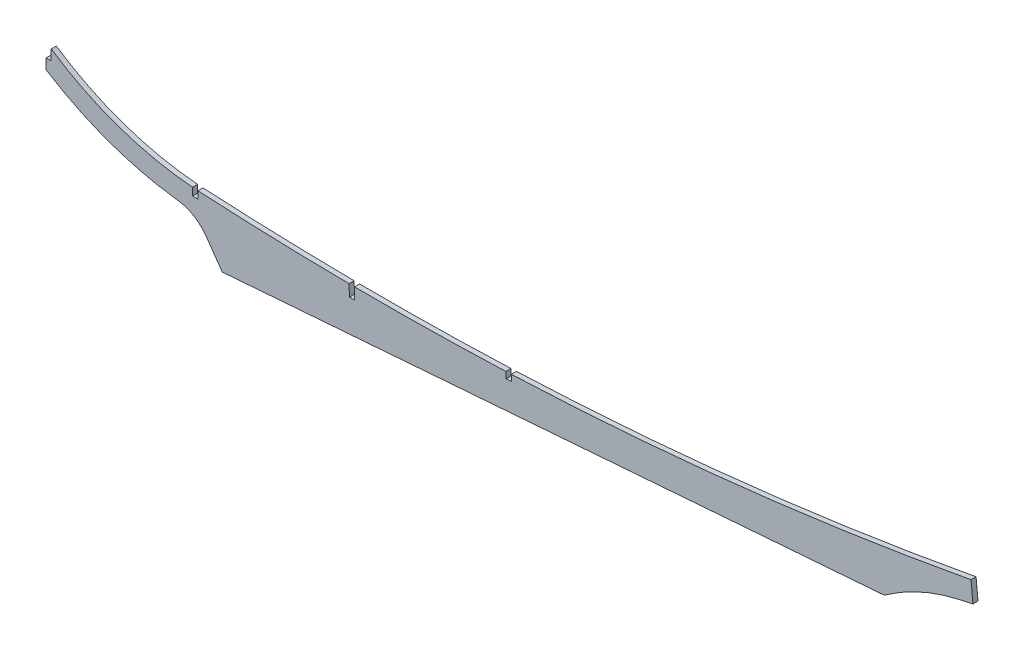
ISO-10303-21;
HEADER;
FILE_DESCRIPTION(('STEP AP214'),'2;1');
FILE_NAME('part.step','',(''),(''),'','','');
FILE_SCHEMA(('AUTOMOTIVE_DESIGN { 1 0 10303 214 1 1 1 1 }'));
ENDSEC;
DATA;
#1=APPLICATION_CONTEXT('core data for automotive mechanical design processes');
#2=APPLICATION_PROTOCOL_DEFINITION('international standard','automotive_design',2000,#1);
#3=PRODUCT_CONTEXT('',#1,'mechanical');
#4=PRODUCT('Part','Part','',(#3));
#5=PRODUCT_RELATED_PRODUCT_CATEGORY('part','',(#4));
#6=PRODUCT_DEFINITION_FORMATION('','',#4);
#7=PRODUCT_DEFINITION_CONTEXT('part definition',#1,'design');
#8=PRODUCT_DEFINITION('design','',#6,#7);
#9=PRODUCT_DEFINITION_SHAPE('','',#8);
#10=(LENGTH_UNIT() NAMED_UNIT(*) SI_UNIT(.MILLI.,.METRE.));
#11=(NAMED_UNIT(*) PLANE_ANGLE_UNIT() SI_UNIT($,.RADIAN.));
#12=(NAMED_UNIT(*) SI_UNIT($,.STERADIAN.) SOLID_ANGLE_UNIT());
#13=UNCERTAINTY_MEASURE_WITH_UNIT(LENGTH_MEASURE(1.E-05),#10,'distance_accuracy_value','');
#14=(GEOMETRIC_REPRESENTATION_CONTEXT(3) GLOBAL_UNCERTAINTY_ASSIGNED_CONTEXT((#13)) GLOBAL_UNIT_ASSIGNED_CONTEXT((#10,
#11,#12)) REPRESENTATION_CONTEXT('',''));
#15=CARTESIAN_POINT('',(0.,0.,0.));
#16=DIRECTION('',(0.,0.,1.));
#17=DIRECTION('',(1.,0.,0.));
#18=AXIS2_PLACEMENT_3D('',#15,#16,#17);
#19=CARTESIAN_POINT('',(209.00386269638,1921.26005107416,1.5875));
#20=DIRECTION('',(0.,0.,-1.));
#21=DIRECTION('',(-1.,0.,0.));
#22=AXIS2_PLACEMENT_3D('',#19,#20,#21);
#23=CYLINDRICAL_SURFACE('',#22,2040.06441212445);
#24=DIRECTION('',(0.,0.,-1.));
#25=VECTOR('',#24,1.);
#26=CARTESIAN_POINT('',(95.6691,-115.653800118673,1.5875));
#27=LINE('',#26,#25);
#28=CARTESIAN_POINT('',(95.6691,-115.653800118673,1.5875));
#29=VERTEX_POINT('',#28);
#30=CARTESIAN_POINT('',(95.6691,-115.653800118673,-1.5875));
#31=VERTEX_POINT('',#30);
#32=EDGE_CURVE('E298',#29,#31,#27,.T.);
#33=ORIENTED_EDGE('',*,*,#32,.F.);
#34=CARTESIAN_POINT('',(209.00386269638,1921.26005107416,1.5875));
#35=DIRECTION('',(0.,0.,1.));
#36=DIRECTION('',(1.,0.,0.));
#37=AXIS2_PLACEMENT_3D('',#34,#35,#36);
#38=CIRCLE('',#37,2040.06441212445);
#39=CARTESIAN_POINT('',(190.812248922999,-118.723250525386,1.5875));
#40=VERTEX_POINT('',#39);
#41=EDGE_CURVE('E249',#29,#40,#38,.T.);
#42=ORIENTED_EDGE('',*,*,#41,.T.);
#43=DIRECTION('',(0.,0.,-1.));
#44=VECTOR('',#43,1.);
#45=CARTESIAN_POINT('',(190.812248922999,-118.723250525385,1.5875));
#46=LINE('',#45,#44);
#47=CARTESIAN_POINT('',(190.812248922999,-118.723250525386,-1.5875));
#48=VERTEX_POINT('',#47);
#49=EDGE_CURVE('E290',#48,#40,#46,.F.);
#50=ORIENTED_EDGE('',*,*,#49,.F.);
#51=CARTESIAN_POINT('',(209.00386269638,1921.26005107416,-1.5875));
#52=DIRECTION('',(0.,0.,1.));
#53=DIRECTION('',(1.,0.,0.));
#54=AXIS2_PLACEMENT_3D('',#51,#52,#53);
#55=CIRCLE('',#54,2040.06441212445);
#56=EDGE_CURVE('E244',#31,#48,#55,.T.);
#57=ORIENTED_EDGE('',*,*,#56,.F.);
#58=EDGE_LOOP('',(#33,#42,#50,#57));
#59=FACE_BOUND('',#58,.T.);
#60=ADVANCED_FACE('F38',(#59),#23,.F.);
#61=DIRECTION('',(0.,0.,-1.));
#62=VECTOR('',#61,1.);
#63=CARTESIAN_POINT('',(194.191761428188,-118.75058793552,1.5875));
#64=LINE('',#63,#62);
#65=CARTESIAN_POINT('',(194.191761428188,-118.750587935521,1.5875));
#66=VERTEX_POINT('',#65);
#67=CARTESIAN_POINT('',(194.191761428188,-118.750587935521,-1.5875));
#68=VERTEX_POINT('',#67);
#69=EDGE_CURVE('E299',#66,#68,#64,.T.);
#70=ORIENTED_EDGE('',*,*,#69,.F.);
#71=CARTESIAN_POINT('',(289.528455693437,-117.21452456796,1.5875));
#72=VERTEX_POINT('',#71);
#73=EDGE_CURVE('E328',#66,#72,#38,.T.);
#74=ORIENTED_EDGE('',*,*,#73,.T.);
#75=DIRECTION('',(0.,0.,-1.));
#76=VECTOR('',#75,1.);
#77=CARTESIAN_POINT('',(289.528455693437,-117.214524567959,1.5875));
#78=LINE('',#77,#76);
#79=CARTESIAN_POINT('',(289.528455693437,-117.21452456796,-1.5875));
#80=VERTEX_POINT('',#79);
#81=EDGE_CURVE('E303',#80,#72,#78,.F.);
#82=ORIENTED_EDGE('',*,*,#81,.F.);
#83=EDGE_CURVE('E243',#68,#80,#55,.T.);
#84=ORIENTED_EDGE('',*,*,#83,.F.);
#85=EDGE_LOOP('',(#70,#74,#82,#84));
#86=FACE_BOUND('',#85,.T.);
#87=ADVANCED_FACE('F337',(#86),#23,.F.);
#88=CARTESIAN_POINT('',(107.235093104916,71.12,1.5875));
#89=DIRECTION('',(0.,0.,-1.));
#90=DIRECTION('',(-1.,0.,0.));
#91=AXIS2_PLACEMENT_3D('',#88,#89,#90);
#92=CYLINDRICAL_SURFACE('',#91,187.149110586238);
#93=DIRECTION('',(0.,0.,-1.));
#94=VECTOR('',#93,1.);
#95=CARTESIAN_POINT('',(3.30200000000001,-84.5164409476936,1.5875));
#96=LINE('',#95,#94);
#97=CARTESIAN_POINT('',(3.30200000000001,-84.5164409476936,1.5875));
#98=VERTEX_POINT('',#97);
#99=CARTESIAN_POINT('',(3.30200000000001,-84.5164409476936,-1.5875));
#100=VERTEX_POINT('',#99);
#101=EDGE_CURVE('E226',#98,#100,#96,.T.);
#102=ORIENTED_EDGE('',*,*,#101,.F.);
#103=CARTESIAN_POINT('',(107.235093104916,71.12,1.5875));
#104=DIRECTION('',(0.,0.,1.));
#105=DIRECTION('',(1.,0.,0.));
#106=AXIS2_PLACEMENT_3D('',#103,#104,#105);
#107=CIRCLE('',#106,187.149110586238);
#108=CARTESIAN_POINT('',(92.2909,-115.431496069217,1.5875));
#109=VERTEX_POINT('',#108);
#110=EDGE_CURVE('E309',#98,#109,#107,.T.);
#111=ORIENTED_EDGE('',*,*,#110,.T.);
#112=DIRECTION('',(0.,0.,-1.));
#113=VECTOR('',#112,1.);
#114=CARTESIAN_POINT('',(92.2909,-115.431496069217,1.5875));
#115=LINE('',#114,#113);
#116=CARTESIAN_POINT('',(92.2909,-115.431496069217,-1.5875));
#117=VERTEX_POINT('',#116);
#118=EDGE_CURVE('E301',#117,#109,#115,.F.);
#119=ORIENTED_EDGE('',*,*,#118,.F.);
#120=CARTESIAN_POINT('',(107.235093104916,71.12,-1.5875));
#121=DIRECTION('',(0.,0.,1.));
#122=DIRECTION('',(1.,0.,0.));
#123=AXIS2_PLACEMENT_3D('',#120,#121,#122);
#124=CIRCLE('',#123,187.149110586238);
#125=EDGE_CURVE('E221',#100,#117,#124,.T.);
#126=ORIENTED_EDGE('',*,*,#125,.F.);
#127=EDGE_LOOP('',(#102,#111,#119,#126));
#128=FACE_BOUND('',#127,.T.);
#129=ADVANCED_FACE('F413',(#128),#92,.F.);
#130=CARTESIAN_POINT('',(0.,0.,1.5875));
#131=DIRECTION('',(-1.,0.,0.));
#132=DIRECTION('',(0.,-1.,0.));
#133=AXIS2_PLACEMENT_3D('',#130,#131,#132);
#134=PLANE('',#133);
#135=DIRECTION('',(0.,0.,1.));
#136=VECTOR('',#135,1.);
#137=CARTESIAN_POINT('',(0.,-91.0752471098096,-1.5875));
#138=LINE('',#137,#136);
#139=CARTESIAN_POINT('',(0.,-91.0752471098096,-1.5875));
#140=VERTEX_POINT('',#139);
#141=CARTESIAN_POINT('',(0.,-91.0752471098096,1.5875));
#142=VERTEX_POINT('',#141);
#143=EDGE_CURVE('E202',#140,#142,#138,.T.);
#144=ORIENTED_EDGE('',*,*,#143,.F.);
#145=DIRECTION('',(0.,1.,0.));
#146=VECTOR('',#145,1.);
#147=CARTESIAN_POINT('',(0.,0.,-1.5875));
#148=LINE('',#147,#146);
#149=CARTESIAN_POINT('',(-2.22044604925031E-13,-97.5,-1.5875));
#150=VERTEX_POINT('',#149);
#151=EDGE_CURVE('E213',#150,#140,#148,.T.);
#152=ORIENTED_EDGE('',*,*,#151,.F.);
#153=DIRECTION('',(0.,0.,-1.));
#154=VECTOR('',#153,1.);
#155=CARTESIAN_POINT('',(-2.22044604925031E-13,-97.5,1.5875));
#156=LINE('',#155,#154);
#157=CARTESIAN_POINT('',(-2.22044604925031E-13,-97.5,1.5875));
#158=VERTEX_POINT('',#157);
#159=EDGE_CURVE('E258',#158,#150,#156,.T.);
#160=ORIENTED_EDGE('',*,*,#159,.F.);
#161=DIRECTION('',(0.,1.,0.));
#162=VECTOR('',#161,1.);
#163=CARTESIAN_POINT('',(0.,0.,1.5875));
#164=LINE('',#163,#162);
#165=EDGE_CURVE('E215',#158,#142,#164,.T.);
#166=ORIENTED_EDGE('',*,*,#165,.T.);
#167=EDGE_LOOP('',(#144,#152,#160,#166));
#168=FACE_BOUND('',#167,.T.);
#169=ADVANCED_FACE('F212',(#168),#134,.T.);
#170=CARTESIAN_POINT('',(107.235093104916,71.12,1.5875));
#171=DIRECTION('',(0.,0.,-1.));
#172=DIRECTION('',(-1.,0.,0.));
#173=AXIS2_PLACEMENT_3D('',#170,#171,#172);
#174=CYLINDRICAL_SURFACE('',#173,199.830101819571);
#175=CARTESIAN_POINT('',(107.235093104916,71.12,-1.5875));
#176=DIRECTION('',(0.,0.,1.));
#177=DIRECTION('',(1.,0.,0.));
#178=AXIS2_PLACEMENT_3D('',#175,#176,#177);
#179=CIRCLE('',#178,199.830101819571);
#180=CARTESIAN_POINT('',(83.0420867198409,-127.240197709298,-1.5875));
#181=VERTEX_POINT('',#180);
#182=EDGE_CURVE('E220',#150,#181,#179,.T.);
#183=ORIENTED_EDGE('',*,*,#182,.T.);
#184=DIRECTION('',(0.,0.,-1.));
#185=VECTOR('',#184,1.);
#186=CARTESIAN_POINT('',(83.0420867198409,-127.240197709298,1.5875));
#187=LINE('',#186,#185);
#188=CARTESIAN_POINT('',(83.0420867198409,-127.240197709298,1.5875));
#189=VERTEX_POINT('',#188);
#190=EDGE_CURVE('E272',#181,#189,#187,.F.);
#191=ORIENTED_EDGE('',*,*,#190,.T.);
#192=CARTESIAN_POINT('',(107.235093104916,71.12,1.5875));
#193=DIRECTION('',(0.,0.,1.));
#194=DIRECTION('',(1.,0.,0.));
#195=AXIS2_PLACEMENT_3D('',#192,#193,#194);
#196=CIRCLE('',#195,199.830101819571);
#197=EDGE_CURVE('E313',#158,#189,#196,.T.);
#198=ORIENTED_EDGE('',*,*,#197,.F.);
#199=ORIENTED_EDGE('',*,*,#159,.T.);
#200=EDGE_LOOP('',(#183,#191,#198,#199));
#201=FACE_BOUND('',#200,.T.);
#202=ADVANCED_FACE('F440',(#201),#174,.T.);
#203=CARTESIAN_POINT('',(2.22985538438366,1.57563672640154,1.5875));
#204=DIRECTION('',(0.816688031445794,0.577079421997696,0.));
#205=DIRECTION('',(-0.577079421997696,0.816688031445794,0.));
#206=AXIS2_PLACEMENT_3D('',#203,#204,#205);
#207=PLANE('',#206);
#208=DIRECTION('',(0.577079421997696,-0.816688031445794,0.));
#209=VECTOR('',#208,1.);
#210=CARTESIAN_POINT('',(2.22985538438366,1.57563672640154,1.5875));
#211=LINE('',#210,#209);
#212=CARTESIAN_POINT('',(100.710838617713,-137.795543852613,1.5875));
#213=VERTEX_POINT('',#212);
#214=CARTESIAN_POINT('',(110.986490965694,-152.33774024361,1.5875));
#215=VERTEX_POINT('',#214);
#216=EDGE_CURVE('E316',#213,#215,#211,.T.);
#217=ORIENTED_EDGE('',*,*,#216,.F.);
#218=DIRECTION('',(0.,0.,1.));
#219=VECTOR('',#218,1.);
#220=CARTESIAN_POINT('',(100.710838617713,-137.795543852613,-1.5875));
#221=LINE('',#220,#219);
#222=CARTESIAN_POINT('',(100.710838617713,-137.795543852613,-1.5875));
#223=VERTEX_POINT('',#222);
#224=EDGE_CURVE('E269',#213,#223,#221,.F.);
#225=ORIENTED_EDGE('',*,*,#224,.T.);
#226=DIRECTION('',(0.577079421997696,-0.816688031445794,0.));
#227=VECTOR('',#226,1.);
#228=CARTESIAN_POINT('',(2.22985538438366,1.57563672640154,-1.5875));
#229=LINE('',#228,#227);
#230=CARTESIAN_POINT('',(110.986490965694,-152.33774024361,-1.5875));
#231=VERTEX_POINT('',#230);
#232=EDGE_CURVE('E223',#223,#231,#229,.T.);
#233=ORIENTED_EDGE('',*,*,#232,.T.);
#234=DIRECTION('',(0.,0.,-1.));
#235=VECTOR('',#234,1.);
#236=CARTESIAN_POINT('',(110.986490965694,-152.33774024361,1.5875));
#237=LINE('',#236,#235);
#238=EDGE_CURVE('E255',#215,#231,#237,.T.);
#239=ORIENTED_EDGE('',*,*,#238,.F.);
#240=EDGE_LOOP('',(#217,#225,#233,#239));
#241=FACE_BOUND('',#240,.T.);
#242=ADVANCED_FACE('F436',(#241),#207,.F.);
#243=CARTESIAN_POINT('',(12.3596923978808,-159.958449832639,1.5875));
#244=DIRECTION('',(-0.0770385113227414,0.997028117844816,0.));
#245=DIRECTION('',(-0.997028117844816,-0.0770385113227414,0.));
#246=AXIS2_PLACEMENT_3D('',#243,#244,#245);
#247=PLANE('',#246);
#248=DIRECTION('',(0.997028117844816,0.0770385113227414,0.));
#249=VECTOR('',#248,1.);
#250=CARTESIAN_POINT('',(12.3596923978808,-159.958449832639,-1.5875));
#251=LINE('',#250,#249);
#252=CARTESIAN_POINT('',(527.710073755712,-120.138282799403,-1.5875));
#253=VERTEX_POINT('',#252);
#254=EDGE_CURVE('E231',#231,#253,#251,.T.);
#255=ORIENTED_EDGE('',*,*,#254,.T.);
#256=DIRECTION('',(0.,0.,-1.));
#257=VECTOR('',#256,1.);
#258=CARTESIAN_POINT('',(527.710073755712,-120.138282799403,1.5875));
#259=LINE('',#258,#257);
#260=CARTESIAN_POINT('',(527.710073755712,-120.138282799403,1.5875));
#261=VERTEX_POINT('',#260);
#262=EDGE_CURVE('E252',#261,#253,#259,.T.);
#263=ORIENTED_EDGE('',*,*,#262,.F.);
#264=DIRECTION('',(0.997028117844816,0.0770385113227414,0.));
#265=VECTOR('',#264,1.);
#266=CARTESIAN_POINT('',(12.3596923978808,-159.958449832639,1.5875));
#267=LINE('',#266,#265);
#268=EDGE_CURVE('E318',#215,#261,#267,.T.);
#269=ORIENTED_EDGE('',*,*,#268,.F.);
#270=ORIENTED_EDGE('',*,*,#238,.T.);
#271=EDGE_LOOP('',(#255,#263,#269,#270));
#272=FACE_BOUND('',#271,.T.);
#273=ADVANCED_FACE('F432',(#272),#247,.F.);
#274=CARTESIAN_POINT('',(230.057828257937,-328.556628861992,1.5875));
#275=DIRECTION('',(-0.573576436351047,0.819152044288991,0.));
#276=DIRECTION('',(-0.819152044288991,-0.573576436351047,0.));
#277=AXIS2_PLACEMENT_3D('',#274,#275,#276);
#278=PLANE('',#277);
#279=DIRECTION('',(0.819152044288991,0.573576436351047,0.));
#280=VECTOR('',#279,1.);
#281=CARTESIAN_POINT('',(230.057828257937,-328.556628861992,-1.5875));
#282=LINE('',#281,#280);
#283=CARTESIAN_POINT('',(529.532384787141,-118.862286878233,-1.5875));
#284=VERTEX_POINT('',#283);
#285=EDGE_CURVE('E233',#253,#284,#282,.T.);
#286=ORIENTED_EDGE('',*,*,#285,.T.);
#287=DIRECTION('',(0.,0.,-1.));
#288=VECTOR('',#287,1.);
#289=CARTESIAN_POINT('',(529.532384787141,-118.862286878233,1.5875));
#290=LINE('',#289,#288);
#291=CARTESIAN_POINT('',(529.532384787141,-118.862286878233,1.5875));
#292=VERTEX_POINT('',#291);
#293=EDGE_CURVE('E263',#284,#292,#290,.F.);
#294=ORIENTED_EDGE('',*,*,#293,.T.);
#295=DIRECTION('',(0.819152044288991,0.573576436351047,0.));
#296=VECTOR('',#295,1.);
#297=CARTESIAN_POINT('',(230.057828257937,-328.556628861992,1.5875));
#298=LINE('',#297,#296);
#299=EDGE_CURVE('E320',#261,#292,#298,.T.);
#300=ORIENTED_EDGE('',*,*,#299,.F.);
#301=ORIENTED_EDGE('',*,*,#262,.T.);
#302=EDGE_LOOP('',(#286,#294,#300,#301));
#303=FACE_BOUND('',#302,.T.);
#304=ADVANCED_FACE('F426',(#303),#278,.F.);
#305=CARTESIAN_POINT('',(47.4401912082167,-215.186600833362,1.5875));
#306=DIRECTION('',(-0.215290899834292,0.976549962085167,0.));
#307=DIRECTION('',(-0.976549962085167,-0.215290899834292,0.));
#308=AXIS2_PLACEMENT_3D('',#305,#306,#307);
#309=PLANE('',#308);
#310=DIRECTION('',(0.976549962085167,0.215290899834292,0.));
#311=VECTOR('',#310,1.);
#312=CARTESIAN_POINT('',(47.4401912082167,-215.186600833362,1.5875));
#313=LINE('',#312,#311);
#314=CARTESIAN_POINT('',(575.034647924769,-98.872751318119,1.5875));
#315=VERTEX_POINT('',#314);
#316=CARTESIAN_POINT('',(583.52308290764,-97.0013848989906,1.5875));
#317=VERTEX_POINT('',#316);
#318=EDGE_CURVE('E323',#315,#317,#313,.T.);
#319=ORIENTED_EDGE('',*,*,#318,.F.);
#320=DIRECTION('',(0.,0.,-1.));
#321=VECTOR('',#320,1.);
#322=CARTESIAN_POINT('',(575.034647924769,-98.872751318119,-1.5875));
#323=LINE('',#322,#321);
#324=CARTESIAN_POINT('',(575.034647924769,-98.872751318119,-1.5875));
#325=VERTEX_POINT('',#324);
#326=EDGE_CURVE('E260',#315,#325,#323,.T.);
#327=ORIENTED_EDGE('',*,*,#326,.T.);
#328=DIRECTION('',(0.976549962085167,0.215290899834292,0.));
#329=VECTOR('',#328,1.);
#330=CARTESIAN_POINT('',(47.4401912082167,-215.186600833362,-1.5875));
#331=LINE('',#330,#329);
#332=CARTESIAN_POINT('',(583.52308290764,-97.0013848989906,-1.5875));
#333=VERTEX_POINT('',#332);
#334=EDGE_CURVE('E236',#325,#333,#331,.T.);
#335=ORIENTED_EDGE('',*,*,#334,.T.);
#336=DIRECTION('',(0.,0.,-1.));
#337=VECTOR('',#336,1.);
#338=CARTESIAN_POINT('',(583.52308290764,-97.0013848989906,1.5875));
#339=LINE('',#338,#337);
#340=EDGE_CURVE('E248',#317,#333,#339,.T.);
#341=ORIENTED_EDGE('',*,*,#340,.F.);
#342=EDGE_LOOP('',(#319,#327,#335,#341));
#343=FACE_BOUND('',#342,.T.);
#344=ADVANCED_FACE('F422',(#343),#309,.F.);
#345=CARTESIAN_POINT('',(568.782339813287,55.1168326892252,1.5875));
#346=DIRECTION('',(-0.995337693784419,-0.0964514143593203,0.));
#347=DIRECTION('',(0.0964514143593203,-0.99533769378442,0.));
#348=AXIS2_PLACEMENT_3D('',#345,#346,#347);
#349=PLANE('',#348);
#350=DIRECTION('',(-0.0964514143593203,0.995337693784419,0.));
#351=VECTOR('',#350,1.);
#352=CARTESIAN_POINT('',(568.782339813287,55.1168326892252,-1.5875));
#353=LINE('',#352,#351);
#354=CARTESIAN_POINT('',(582.298149945277,-84.3605961879285,-1.5875));
#355=VERTEX_POINT('',#354);
#356=EDGE_CURVE('E238',#333,#355,#353,.T.);
#357=ORIENTED_EDGE('',*,*,#356,.T.);
#358=DIRECTION('',(0.,0.,-1.));
#359=VECTOR('',#358,1.);
#360=CARTESIAN_POINT('',(582.298149945277,-84.3605961879285,1.5875));
#361=LINE('',#360,#359);
#362=CARTESIAN_POINT('',(582.298149945277,-84.3605961879285,1.5875));
#363=VERTEX_POINT('',#362);
#364=EDGE_CURVE('E245',#363,#355,#361,.T.);
#365=ORIENTED_EDGE('',*,*,#364,.F.);
#366=DIRECTION('',(-0.0964514143593203,0.995337693784419,0.));
#367=VECTOR('',#366,1.);
#368=CARTESIAN_POINT('',(568.782339813287,55.1168326892252,1.5875));
#369=LINE('',#368,#367);
#370=EDGE_CURVE('E325',#317,#363,#369,.T.);
#371=ORIENTED_EDGE('',*,*,#370,.F.);
#372=ORIENTED_EDGE('',*,*,#340,.T.);
#373=EDGE_LOOP('',(#357,#365,#371,#372));
#374=FACE_BOUND('',#373,.T.);
#375=ADVANCED_FACE('F393',(#374),#349,.F.);
#376=DIRECTION('',(0.,0.,-1.));
#377=VECTOR('',#376,1.);
#378=CARTESIAN_POINT('',(292.903923813643,-117.078386320666,1.5875));
#379=LINE('',#378,#377);
#380=CARTESIAN_POINT('',(292.903923813643,-117.078386320667,1.5875));
#381=VERTEX_POINT('',#380);
#382=CARTESIAN_POINT('',(292.903923813643,-117.078386320667,-1.5875));
#383=VERTEX_POINT('',#382);
#384=EDGE_CURVE('E368',#381,#383,#379,.T.);
#385=ORIENTED_EDGE('',*,*,#384,.F.);
#386=EDGE_CURVE('E327',#381,#363,#38,.T.);
#387=ORIENTED_EDGE('',*,*,#386,.T.);
#388=ORIENTED_EDGE('',*,*,#364,.T.);
#389=EDGE_CURVE('E241',#383,#355,#55,.T.);
#390=ORIENTED_EDGE('',*,*,#389,.F.);
#391=EDGE_LOOP('',(#385,#387,#388,#390));
#392=FACE_BOUND('',#391,.T.);
#393=ADVANCED_FACE('F387',(#392),#23,.F.);
#394=CARTESIAN_POINT('',(0.,0.,1.5875));
#395=DIRECTION('',(0.,0.,1.));
#396=DIRECTION('',(1.,0.,0.));
#397=AXIS2_PLACEMENT_3D('',#394,#395,#396);
#398=PLANE('',#397);
#399=DIRECTION('',(0.,1.,0.));
#400=VECTOR('',#399,1.);
#401=CARTESIAN_POINT('',(3.30200000000001,-91.0752471098096,1.5875));
#402=LINE('',#401,#400);
#403=CARTESIAN_POINT('',(3.30200000000001,-91.0752471098096,1.5875));
#404=VERTEX_POINT('',#403);
#405=EDGE_CURVE('E207',#404,#98,#402,.T.);
#406=ORIENTED_EDGE('',*,*,#405,.F.);
#407=DIRECTION('',(1.,0.,0.));
#408=VECTOR('',#407,1.);
#409=CARTESIAN_POINT('',(0.,-91.0752471098096,1.5875));
#410=LINE('',#409,#408);
#411=EDGE_CURVE('E472',#142,#404,#410,.T.);
#412=ORIENTED_EDGE('',*,*,#411,.F.);
#413=ORIENTED_EDGE('',*,*,#165,.F.);
#414=ORIENTED_EDGE('',*,*,#197,.T.);
#415=CARTESIAN_POINT('',(79.9669626189898,-152.453361171354,1.5875));
#416=DIRECTION('',(0.,0.,1.));
#417=DIRECTION('',(1.,0.,0.));
#418=AXIS2_PLACEMENT_3D('',#415,#416,#417);
#419=CIRCLE('',#418,25.4);
#420=EDGE_CURVE('E276',#189,#213,#419,.F.);
#421=ORIENTED_EDGE('',*,*,#420,.T.);
#422=ORIENTED_EDGE('',*,*,#216,.T.);
#423=ORIENTED_EDGE('',*,*,#268,.T.);
#424=ORIENTED_EDGE('',*,*,#299,.T.);
#425=CARTESIAN_POINT('',(602.376592203724,-222.894596502935,1.5875));
#426=DIRECTION('',(0.,0.,1.));
#427=DIRECTION('',(1.,0.,0.));
#428=AXIS2_PLACEMENT_3D('',#425,#426,#427);
#429=CIRCLE('',#428,127.);
#430=EDGE_CURVE('E267',#292,#315,#429,.F.);
#431=ORIENTED_EDGE('',*,*,#430,.T.);
#432=ORIENTED_EDGE('',*,*,#318,.T.);
#433=ORIENTED_EDGE('',*,*,#370,.T.);
#434=ORIENTED_EDGE('',*,*,#386,.F.);
#435=DIRECTION('',(-0.0430000788380031,0.999075068861157,0.));
#436=VECTOR('',#435,1.);
#437=CARTESIAN_POINT('',(293.073061119761,-121.008166691369,1.5875));
#438=LINE('',#437,#436);
#439=CARTESIAN_POINT('',(293.073061119761,-121.008166691369,1.5875));
#440=VERTEX_POINT('',#439);
#441=EDGE_CURVE('E357',#440,#381,#438,.T.);
#442=ORIENTED_EDGE('',*,*,#441,.F.);
#443=DIRECTION('',(0.999075068861157,0.0430000788380023,0.));
#444=VECTOR('',#443,1.);
#445=CARTESIAN_POINT('',(289.697985722134,-121.1534295577,1.5875));
#446=LINE('',#445,#444);
#447=CARTESIAN_POINT('',(289.697985722134,-121.1534295577,1.5875));
#448=VERTEX_POINT('',#447);
#449=EDGE_CURVE('E351',#448,#440,#446,.T.);
#450=ORIENTED_EDGE('',*,*,#449,.F.);
#451=DIRECTION('',(0.0430000788380031,-0.999075068861157,0.));
#452=VECTOR('',#451,1.);
#453=CARTESIAN_POINT('',(289.697985722134,-121.1534295577,1.5875));
#454=LINE('',#453,#452);
#455=EDGE_CURVE('E348',#72,#448,#454,.T.);
#456=ORIENTED_EDGE('',*,*,#455,.F.);
#457=ORIENTED_EDGE('',*,*,#73,.F.);
#458=DIRECTION('',(-0.0209302977680573,0.999780937323442,0.));
#459=VECTOR('',#458,1.);
#460=CARTESIAN_POINT('',(194.342678534027,-125.959469873391,1.5875));
#461=LINE('',#460,#459);
#462=CARTESIAN_POINT('',(194.342678534027,-125.959469873391,1.5875));
#463=VERTEX_POINT('',#462);
#464=EDGE_CURVE('E346',#463,#66,#461,.T.);
#465=ORIENTED_EDGE('',*,*,#464,.F.);
#466=DIRECTION('',(0.999780937323442,0.0209302977680589,0.));
#467=VECTOR('',#466,1.);
#468=CARTESIAN_POINT('',(190.965218571561,-126.030176605311,1.5875));
#469=LINE('',#468,#467);
#470=CARTESIAN_POINT('',(190.965218571561,-126.030176605311,1.5875));
#471=VERTEX_POINT('',#470);
#472=EDGE_CURVE('E495',#471,#463,#469,.T.);
#473=ORIENTED_EDGE('',*,*,#472,.F.);
#474=DIRECTION('',(0.0209302977680573,-0.999780937323442,0.));
#475=VECTOR('',#474,1.);
#476=CARTESIAN_POINT('',(190.965218571561,-126.030176605311,1.5875));
#477=LINE('',#476,#475);
#478=EDGE_CURVE('E378',#40,#471,#477,.T.);
#479=ORIENTED_EDGE('',*,*,#478,.F.);
#480=ORIENTED_EDGE('',*,*,#41,.F.);
#481=DIRECTION('',(0.,1.,0.));
#482=VECTOR('',#481,1.);
#483=CARTESIAN_POINT('',(95.6691,-120.263391429802,1.5875));
#484=LINE('',#483,#482);
#485=CARTESIAN_POINT('',(95.6691,-120.263391429802,1.5875));
#486=VERTEX_POINT('',#485);
#487=EDGE_CURVE('E487',#486,#29,#484,.T.);
#488=ORIENTED_EDGE('',*,*,#487,.F.);
#489=DIRECTION('',(1.,0.,0.));
#490=VECTOR('',#489,1.);
#491=CARTESIAN_POINT('',(92.2909,-120.263391429802,1.5875));
#492=LINE('',#491,#490);
#493=CARTESIAN_POINT('',(92.2909,-120.263391429802,1.5875));
#494=VERTEX_POINT('',#493);
#495=EDGE_CURVE('E477',#494,#486,#492,.T.);
#496=ORIENTED_EDGE('',*,*,#495,.F.);
#497=DIRECTION('',(0.,-1.,0.));
#498=VECTOR('',#497,1.);
#499=CARTESIAN_POINT('',(92.2909,-120.263391429802,1.5875));
#500=LINE('',#499,#498);
#501=EDGE_CURVE('E474',#109,#494,#500,.T.);
#502=ORIENTED_EDGE('',*,*,#501,.F.);
#503=ORIENTED_EDGE('',*,*,#110,.F.);
#504=EDGE_LOOP('',(#406,#412,#413,#414,#421,#422,#423,#424,#431,#432,#433,#434,#442,#450,#456,
#457,#465,#473,#479,#480,#488,#496,#502,#503));
#505=FACE_BOUND('',#504,.T.);
#506=ADVANCED_FACE('F344',(#505),#398,.T.);
#507=CARTESIAN_POINT('',(0.,0.,-1.5875));
#508=DIRECTION('',(0.,0.,1.));
#509=DIRECTION('',(1.,0.,0.));
#510=AXIS2_PLACEMENT_3D('',#507,#508,#509);
#511=PLANE('',#510);
#512=DIRECTION('',(1.,0.,0.));
#513=VECTOR('',#512,1.);
#514=CARTESIAN_POINT('',(0.,-91.0752471098096,-1.5875));
#515=LINE('',#514,#513);
#516=CARTESIAN_POINT('',(3.30200000000001,-91.0752471098096,-1.5875));
#517=VERTEX_POINT('',#516);
#518=EDGE_CURVE('E198',#140,#517,#515,.T.);
#519=ORIENTED_EDGE('',*,*,#518,.T.);
#520=DIRECTION('',(0.,1.,0.));
#521=VECTOR('',#520,1.);
#522=CARTESIAN_POINT('',(3.30200000000001,-91.0752471098096,-1.5875));
#523=LINE('',#522,#521);
#524=EDGE_CURVE('E53',#517,#100,#523,.T.);
#525=ORIENTED_EDGE('',*,*,#524,.T.);
#526=ORIENTED_EDGE('',*,*,#125,.T.);
#527=DIRECTION('',(0.,-1.,0.));
#528=VECTOR('',#527,1.);
#529=CARTESIAN_POINT('',(92.2908999999999,1.00849883999387E-13,-1.5875));
#530=LINE('',#529,#528);
#531=CARTESIAN_POINT('',(92.2909,-120.263391429802,-1.5875));
#532=VERTEX_POINT('',#531);
#533=EDGE_CURVE('E11',#117,#532,#530,.T.);
#534=ORIENTED_EDGE('',*,*,#533,.T.);
#535=DIRECTION('',(1.,0.,0.));
#536=VECTOR('',#535,1.);
#537=CARTESIAN_POINT('',(92.2909,-120.263391429802,-1.5875));
#538=LINE('',#537,#536);
#539=CARTESIAN_POINT('',(95.6691,-120.263391429802,-1.5875));
#540=VERTEX_POINT('',#539);
#541=EDGE_CURVE('E489',#532,#540,#538,.T.);
#542=ORIENTED_EDGE('',*,*,#541,.T.);
#543=DIRECTION('',(0.,1.,0.));
#544=VECTOR('',#543,1.);
#545=CARTESIAN_POINT('',(95.6691,-120.263391429802,-1.5875));
#546=LINE('',#545,#544);
#547=EDGE_CURVE('E61',#540,#31,#546,.T.);
#548=ORIENTED_EDGE('',*,*,#547,.T.);
#549=ORIENTED_EDGE('',*,*,#56,.T.);
#550=DIRECTION('',(0.0209302977680573,-0.999780937323442,0.));
#551=VECTOR('',#550,1.);
#552=CARTESIAN_POINT('',(188.244289762047,3.94087233589798,-1.5875));
#553=LINE('',#552,#551);
#554=CARTESIAN_POINT('',(190.965218571561,-126.030176605311,-1.5875));
#555=VERTEX_POINT('',#554);
#556=EDGE_CURVE('E46',#48,#555,#553,.T.);
#557=ORIENTED_EDGE('',*,*,#556,.T.);
#558=DIRECTION('',(0.999780937323442,0.0209302977680589,0.));
#559=VECTOR('',#558,1.);
#560=CARTESIAN_POINT('',(190.965218571561,-126.030176605311,-1.5875));
#561=LINE('',#560,#559);
#562=CARTESIAN_POINT('',(194.342678534027,-125.959469873391,-1.5875));
#563=VERTEX_POINT('',#562);
#564=EDGE_CURVE('E285',#555,#563,#561,.T.);
#565=ORIENTED_EDGE('',*,*,#564,.T.);
#566=DIRECTION('',(-0.0209302977680573,0.999780937323442,0.));
#567=VECTOR('',#566,1.);
#568=CARTESIAN_POINT('',(194.342678534027,-125.959469873391,-1.5875));
#569=LINE('',#568,#567);
#570=EDGE_CURVE('E371',#563,#68,#569,.T.);
#571=ORIENTED_EDGE('',*,*,#570,.T.);
#572=ORIENTED_EDGE('',*,*,#83,.T.);
#573=DIRECTION('',(0.0430000788380031,-0.999075068861157,0.));
#574=VECTOR('',#573,1.);
#575=CARTESIAN_POINT('',(283.957543687641,12.2215008118786,-1.5875));
#576=LINE('',#575,#574);
#577=CARTESIAN_POINT('',(289.697985722134,-121.1534295577,-1.5875));
#578=VERTEX_POINT('',#577);
#579=EDGE_CURVE('E278',#80,#578,#576,.T.);
#580=ORIENTED_EDGE('',*,*,#579,.T.);
#581=DIRECTION('',(0.999075068861157,0.0430000788380023,0.));
#582=VECTOR('',#581,1.);
#583=CARTESIAN_POINT('',(289.697985722134,-121.1534295577,-1.5875));
#584=LINE('',#583,#582);
#585=CARTESIAN_POINT('',(293.073061119761,-121.008166691369,-1.5875));
#586=VERTEX_POINT('',#585);
#587=EDGE_CURVE('E364',#578,#586,#584,.T.);
#588=ORIENTED_EDGE('',*,*,#587,.T.);
#589=DIRECTION('',(-0.0430000788380031,0.999075068861157,0.));
#590=VECTOR('',#589,1.);
#591=CARTESIAN_POINT('',(293.073061119761,-121.008166691369,-1.5875));
#592=LINE('',#591,#590);
#593=EDGE_CURVE('E361',#586,#383,#592,.T.);
#594=ORIENTED_EDGE('',*,*,#593,.T.);
#595=ORIENTED_EDGE('',*,*,#389,.T.);
#596=ORIENTED_EDGE('',*,*,#356,.F.);
#597=ORIENTED_EDGE('',*,*,#334,.F.);
#598=CARTESIAN_POINT('',(602.376592203724,-222.894596502935,-1.5875));
#599=DIRECTION('',(0.,0.,1.));
#600=DIRECTION('',(1.,0.,0.));
#601=AXIS2_PLACEMENT_3D('',#598,#599,#600);
#602=CIRCLE('',#601,127.);
#603=EDGE_CURVE('E265',#325,#284,#602,.T.);
#604=ORIENTED_EDGE('',*,*,#603,.T.);
#605=ORIENTED_EDGE('',*,*,#285,.F.);
#606=ORIENTED_EDGE('',*,*,#254,.F.);
#607=ORIENTED_EDGE('',*,*,#232,.F.);
#608=CARTESIAN_POINT('',(79.9669626189898,-152.453361171354,-1.5875));
#609=DIRECTION('',(0.,0.,1.));
#610=DIRECTION('',(1.,0.,0.));
#611=AXIS2_PLACEMENT_3D('',#608,#609,#610);
#612=CIRCLE('',#611,25.4);
#613=EDGE_CURVE('E274',#223,#181,#612,.T.);
#614=ORIENTED_EDGE('',*,*,#613,.T.);
#615=ORIENTED_EDGE('',*,*,#182,.F.);
#616=ORIENTED_EDGE('',*,*,#151,.T.);
#617=EDGE_LOOP('',(#519,#525,#526,#534,#542,#548,#549,#557,#565,#571,#572,#580,#588,#594,#595,
#596,#597,#604,#605,#606,#607,#614,#615,#616));
#618=FACE_BOUND('',#617,.T.);
#619=ADVANCED_FACE('F218',(#618),#511,.F.);
#620=CARTESIAN_POINT('',(602.376592203724,-222.894596502935,1.5875));
#621=DIRECTION('',(0.,0.,1.));
#622=DIRECTION('',(1.,0.,0.));
#623=AXIS2_PLACEMENT_3D('',#620,#621,#622);
#624=CYLINDRICAL_SURFACE('',#623,127.);
#625=ORIENTED_EDGE('',*,*,#430,.F.);
#626=ORIENTED_EDGE('',*,*,#293,.F.);
#627=ORIENTED_EDGE('',*,*,#603,.F.);
#628=ORIENTED_EDGE('',*,*,#326,.F.);
#629=EDGE_LOOP('',(#625,#626,#627,#628));
#630=FACE_BOUND('',#629,.T.);
#631=ADVANCED_FACE('F449',(#630),#624,.F.);
#632=CARTESIAN_POINT('',(79.9669626189898,-152.453361171354,1.5875));
#633=DIRECTION('',(0.,0.,-1.));
#634=DIRECTION('',(-1.,0.,0.));
#635=AXIS2_PLACEMENT_3D('',#632,#633,#634);
#636=CYLINDRICAL_SURFACE('',#635,25.4);
#637=ORIENTED_EDGE('',*,*,#420,.F.);
#638=ORIENTED_EDGE('',*,*,#190,.F.);
#639=ORIENTED_EDGE('',*,*,#613,.F.);
#640=ORIENTED_EDGE('',*,*,#224,.F.);
#641=EDGE_LOOP('',(#637,#638,#639,#640));
#642=FACE_BOUND('',#641,.T.);
#643=ADVANCED_FACE('F40',(#642),#636,.F.);
#644=CARTESIAN_POINT('',(289.697985722134,-121.1534295577,-1.5875));
#645=DIRECTION('',(-0.999075068861157,-0.0430000788380031,0.));
#646=DIRECTION('',(0.0430000788380031,-0.999075068861157,0.));
#647=AXIS2_PLACEMENT_3D('',#644,#645,#646);
#648=PLANE('',#647);
#649=ORIENTED_EDGE('',*,*,#81,.T.);
#650=ORIENTED_EDGE('',*,*,#455,.T.);
#651=DIRECTION('',(0.,0.,1.));
#652=VECTOR('',#651,1.);
#653=CARTESIAN_POINT('',(289.697985722134,-121.1534295577,-1.5875));
#654=LINE('',#653,#652);
#655=EDGE_CURVE('E365',#578,#448,#654,.T.);
#656=ORIENTED_EDGE('',*,*,#655,.F.);
#657=ORIENTED_EDGE('',*,*,#579,.F.);
#658=EDGE_LOOP('',(#649,#650,#656,#657));
#659=FACE_BOUND('',#658,.T.);
#660=ADVANCED_FACE('F369',(#659),#648,.F.);
#661=CARTESIAN_POINT('',(293.073061119761,-121.008166691369,-1.5875));
#662=DIRECTION('',(0.999075068861157,0.0430000788380031,0.));
#663=DIRECTION('',(-0.0430000788380031,0.999075068861157,0.));
#664=AXIS2_PLACEMENT_3D('',#661,#662,#663);
#665=PLANE('',#664);
#666=ORIENTED_EDGE('',*,*,#384,.T.);
#667=ORIENTED_EDGE('',*,*,#593,.F.);
#668=DIRECTION('',(0.,0.,1.));
#669=VECTOR('',#668,1.);
#670=CARTESIAN_POINT('',(293.073061119761,-121.008166691369,-1.5875));
#671=LINE('',#670,#669);
#672=EDGE_CURVE('E382',#586,#440,#671,.T.);
#673=ORIENTED_EDGE('',*,*,#672,.T.);
#674=ORIENTED_EDGE('',*,*,#441,.T.);
#675=EDGE_LOOP('',(#666,#667,#673,#674));
#676=FACE_BOUND('',#675,.T.);
#677=ADVANCED_FACE('F384',(#676),#665,.F.);
#678=CARTESIAN_POINT('',(289.697985722134,-121.1534295577,-1.5875));
#679=DIRECTION('',(0.0430000788380023,-0.999075068861157,0.));
#680=DIRECTION('',(0.999075068861157,0.0430000788380023,0.));
#681=AXIS2_PLACEMENT_3D('',#678,#679,#680);
#682=PLANE('',#681);
#683=ORIENTED_EDGE('',*,*,#449,.T.);
#684=ORIENTED_EDGE('',*,*,#672,.F.);
#685=ORIENTED_EDGE('',*,*,#587,.F.);
#686=ORIENTED_EDGE('',*,*,#655,.T.);
#687=EDGE_LOOP('',(#683,#684,#685,#686));
#688=FACE_BOUND('',#687,.T.);
#689=ADVANCED_FACE('F397',(#688),#682,.F.);
#690=CARTESIAN_POINT('',(190.965218571561,-126.030176605311,-1.5875));
#691=DIRECTION('',(-0.999780937323442,-0.0209302977680573,0.));
#692=DIRECTION('',(0.0209302977680573,-0.999780937323442,0.));
#693=AXIS2_PLACEMENT_3D('',#690,#691,#692);
#694=PLANE('',#693);
#695=ORIENTED_EDGE('',*,*,#49,.T.);
#696=ORIENTED_EDGE('',*,*,#478,.T.);
#697=DIRECTION('',(0.,0.,1.));
#698=VECTOR('',#697,1.);
#699=CARTESIAN_POINT('',(190.965218571561,-126.030176605311,-1.5875));
#700=LINE('',#699,#698);
#701=EDGE_CURVE('E293',#555,#471,#700,.T.);
#702=ORIENTED_EDGE('',*,*,#701,.F.);
#703=ORIENTED_EDGE('',*,*,#556,.F.);
#704=EDGE_LOOP('',(#695,#696,#702,#703));
#705=FACE_BOUND('',#704,.T.);
#706=ADVANCED_FACE('F289',(#705),#694,.F.);
#707=CARTESIAN_POINT('',(194.342678534027,-125.959469873391,-1.5875));
#708=DIRECTION('',(0.999780937323442,0.0209302977680573,0.));
#709=DIRECTION('',(-0.0209302977680573,0.999780937323442,0.));
#710=AXIS2_PLACEMENT_3D('',#707,#708,#709);
#711=PLANE('',#710);
#712=ORIENTED_EDGE('',*,*,#69,.T.);
#713=ORIENTED_EDGE('',*,*,#570,.F.);
#714=DIRECTION('',(0.,0.,1.));
#715=VECTOR('',#714,1.);
#716=CARTESIAN_POINT('',(194.342678534027,-125.959469873391,-1.5875));
#717=LINE('',#716,#715);
#718=EDGE_CURVE('E354',#563,#463,#717,.T.);
#719=ORIENTED_EDGE('',*,*,#718,.T.);
#720=ORIENTED_EDGE('',*,*,#464,.T.);
#721=EDGE_LOOP('',(#712,#713,#719,#720));
#722=FACE_BOUND('',#721,.T.);
#723=ADVANCED_FACE('F404',(#722),#711,.F.);
#724=CARTESIAN_POINT('',(190.965218571561,-126.030176605311,-1.5875));
#725=DIRECTION('',(0.0209302977680589,-0.999780937323442,0.));
#726=DIRECTION('',(0.999780937323442,0.0209302977680589,0.));
#727=AXIS2_PLACEMENT_3D('',#724,#725,#726);
#728=PLANE('',#727);
#729=ORIENTED_EDGE('',*,*,#472,.T.);
#730=ORIENTED_EDGE('',*,*,#718,.F.);
#731=ORIENTED_EDGE('',*,*,#564,.F.);
#732=ORIENTED_EDGE('',*,*,#701,.T.);
#733=EDGE_LOOP('',(#729,#730,#731,#732));
#734=FACE_BOUND('',#733,.T.);
#735=ADVANCED_FACE('F498',(#734),#728,.F.);
#736=CARTESIAN_POINT('',(92.2909,-120.263391429802,-1.5875));
#737=DIRECTION('',(-1.,0.,0.));
#738=DIRECTION('',(0.,-1.,0.));
#739=AXIS2_PLACEMENT_3D('',#736,#737,#738);
#740=PLANE('',#739);
#741=ORIENTED_EDGE('',*,*,#118,.T.);
#742=ORIENTED_EDGE('',*,*,#501,.T.);
#743=DIRECTION('',(0.,0.,1.));
#744=VECTOR('',#743,1.);
#745=CARTESIAN_POINT('',(92.2909,-120.263391429802,-1.5875));
#746=LINE('',#745,#744);
#747=EDGE_CURVE('E482',#532,#494,#746,.T.);
#748=ORIENTED_EDGE('',*,*,#747,.F.);
#749=ORIENTED_EDGE('',*,*,#533,.F.);
#750=EDGE_LOOP('',(#741,#742,#748,#749));
#751=FACE_BOUND('',#750,.T.);
#752=ADVANCED_FACE('F504',(#751),#740,.F.);
#753=CARTESIAN_POINT('',(95.6691,-120.263391429802,-1.5875));
#754=DIRECTION('',(1.,0.,0.));
#755=DIRECTION('',(0.,0.,-1.));
#756=AXIS2_PLACEMENT_3D('',#753,#754,#755);
#757=PLANE('',#756);
#758=ORIENTED_EDGE('',*,*,#32,.T.);
#759=ORIENTED_EDGE('',*,*,#547,.F.);
#760=DIRECTION('',(0.,0.,1.));
#761=VECTOR('',#760,1.);
#762=CARTESIAN_POINT('',(95.6691,-120.263391429802,-1.5875));
#763=LINE('',#762,#761);
#764=EDGE_CURVE('E485',#540,#486,#763,.T.);
#765=ORIENTED_EDGE('',*,*,#764,.T.);
#766=ORIENTED_EDGE('',*,*,#487,.T.);
#767=EDGE_LOOP('',(#758,#759,#765,#766));
#768=FACE_BOUND('',#767,.T.);
#769=ADVANCED_FACE('F550',(#768),#757,.F.);
#770=CARTESIAN_POINT('',(92.2909,-120.263391429802,-1.5875));
#771=DIRECTION('',(0.,-1.,0.));
#772=DIRECTION('',(0.,0.,-1.));
#773=AXIS2_PLACEMENT_3D('',#770,#771,#772);
#774=PLANE('',#773);
#775=ORIENTED_EDGE('',*,*,#495,.T.);
#776=ORIENTED_EDGE('',*,*,#764,.F.);
#777=ORIENTED_EDGE('',*,*,#541,.F.);
#778=ORIENTED_EDGE('',*,*,#747,.T.);
#779=EDGE_LOOP('',(#775,#776,#777,#778));
#780=FACE_BOUND('',#779,.T.);
#781=ADVANCED_FACE('F561',(#780),#774,.F.);
#782=CARTESIAN_POINT('',(3.30200000000001,-91.0752471098096,-1.5875));
#783=DIRECTION('',(1.,0.,0.));
#784=DIRECTION('',(0.,0.,-1.));
#785=AXIS2_PLACEMENT_3D('',#782,#783,#784);
#786=PLANE('',#785);
#787=ORIENTED_EDGE('',*,*,#101,.T.);
#788=ORIENTED_EDGE('',*,*,#524,.F.);
#789=DIRECTION('',(0.,0.,1.));
#790=VECTOR('',#789,1.);
#791=CARTESIAN_POINT('',(3.30200000000001,-91.0752471098096,-1.5875));
#792=LINE('',#791,#790);
#793=EDGE_CURVE('E204',#517,#404,#792,.T.);
#794=ORIENTED_EDGE('',*,*,#793,.T.);
#795=ORIENTED_EDGE('',*,*,#405,.T.);
#796=EDGE_LOOP('',(#787,#788,#794,#795));
#797=FACE_BOUND('',#796,.T.);
#798=ADVANCED_FACE('F571',(#797),#786,.F.);
#799=CARTESIAN_POINT('',(0.,-91.0752471098096,-1.5875));
#800=DIRECTION('',(0.,-1.,0.));
#801=DIRECTION('',(0.,0.,-1.));
#802=AXIS2_PLACEMENT_3D('',#799,#800,#801);
#803=PLANE('',#802);
#804=ORIENTED_EDGE('',*,*,#411,.T.);
#805=ORIENTED_EDGE('',*,*,#793,.F.);
#806=ORIENTED_EDGE('',*,*,#518,.F.);
#807=ORIENTED_EDGE('',*,*,#143,.T.);
#808=EDGE_LOOP('',(#804,#805,#806,#807));
#809=FACE_BOUND('',#808,.T.);
#810=ADVANCED_FACE('F201',(#809),#803,.F.);
#811=CLOSED_SHELL('',(#60,#87,#129,#169,#202,#242,#273,#304,#344,#375,#393,#506,#619,#631,#643,
#660,#677,#689,#706,#723,#735,#752,#769,#781,#798,#810));
#812=MANIFOLD_SOLID_BREP('B2',#811);
#813=ADVANCED_BREP_SHAPE_REPRESENTATION('',(#18,#812),#14);
#814=SHAPE_DEFINITION_REPRESENTATION(#9,#813);
ENDSEC;
END-ISO-10303-21;
